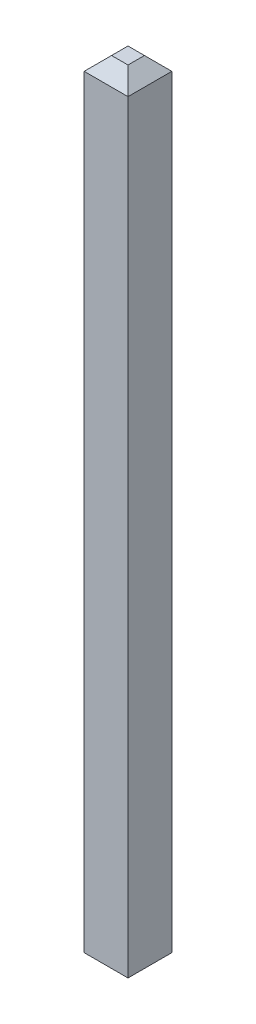
ISO-10303-21;
HEADER;
FILE_DESCRIPTION(('STEP AP214'),'2;1');
FILE_NAME('part.step','',(''),(''),'','','');
FILE_SCHEMA(('AUTOMOTIVE_DESIGN { 1 0 10303 214 1 1 1 1 }'));
ENDSEC;
DATA;
#1=APPLICATION_CONTEXT('core data for automotive mechanical design processes');
#2=APPLICATION_PROTOCOL_DEFINITION('international standard','automotive_design',2000,#1);
#3=PRODUCT_CONTEXT('',#1,'mechanical');
#4=PRODUCT('Part','Part','',(#3));
#5=PRODUCT_RELATED_PRODUCT_CATEGORY('part','',(#4));
#6=PRODUCT_DEFINITION_FORMATION('','',#4);
#7=PRODUCT_DEFINITION_CONTEXT('part definition',#1,'design');
#8=PRODUCT_DEFINITION('design','',#6,#7);
#9=PRODUCT_DEFINITION_SHAPE('','',#8);
#10=(LENGTH_UNIT() NAMED_UNIT(*) SI_UNIT(.MILLI.,.METRE.));
#11=(NAMED_UNIT(*) PLANE_ANGLE_UNIT() SI_UNIT($,.RADIAN.));
#12=(NAMED_UNIT(*) SI_UNIT($,.STERADIAN.) SOLID_ANGLE_UNIT());
#13=UNCERTAINTY_MEASURE_WITH_UNIT(LENGTH_MEASURE(1.E-05),#10,'distance_accuracy_value','');
#14=(GEOMETRIC_REPRESENTATION_CONTEXT(3) GLOBAL_UNCERTAINTY_ASSIGNED_CONTEXT((#13)) GLOBAL_UNIT_ASSIGNED_CONTEXT((#10,
#11,#12)) REPRESENTATION_CONTEXT('',''));
#15=CARTESIAN_POINT('',(0.,0.,0.));
#16=DIRECTION('',(0.,0.,1.));
#17=DIRECTION('',(1.,0.,0.));
#18=AXIS2_PLACEMENT_3D('',#15,#16,#17);
#19=CARTESIAN_POINT('',(-8.57,7.07,-0.32));
#20=DIRECTION('',(-0.707106781186548,-0.707106781186548,0.));
#21=DIRECTION('',(-0.707106781186548,0.707106781186548,0.));
#22=AXIS2_PLACEMENT_3D('',#19,#20,#21);
#23=PLANE('',#22);
#24=DIRECTION('',(0.577350269189626,-0.577350269189626,0.577350269189626));
#25=VECTOR('',#24,1.);
#26=CARTESIAN_POINT('',(-8.783333333333,7.283333333333,0.106666666667));
#27=LINE('',#26,#25);
#28=CARTESIAN_POINT('',(-8.77,7.27,0.12));
#29=VERTEX_POINT('',#28);
#30=CARTESIAN_POINT('',(-8.57,7.07,0.32));
#31=VERTEX_POINT('',#30);
#32=EDGE_CURVE('E152',#29,#31,#27,.T.);
#33=ORIENTED_EDGE('',*,*,#32,.T.);
#34=DIRECTION('',(0.,0.,1.));
#35=VECTOR('',#34,1.);
#36=CARTESIAN_POINT('',(-8.57,7.07,-0.32));
#37=LINE('',#36,#35);
#38=CARTESIAN_POINT('',(-8.57,7.07,-0.32));
#39=VERTEX_POINT('',#38);
#40=EDGE_CURVE('E171',#39,#31,#37,.T.);
#41=ORIENTED_EDGE('',*,*,#40,.F.);
#42=DIRECTION('',(0.577350269189626,-0.577350269189626,-0.577350269189626));
#43=VECTOR('',#42,1.);
#44=CARTESIAN_POINT('',(-8.57,7.07,-0.32));
#45=LINE('',#44,#43);
#46=CARTESIAN_POINT('',(-8.77,7.27,-0.12));
#47=VERTEX_POINT('',#46);
#48=EDGE_CURVE('E11',#47,#39,#45,.T.);
#49=ORIENTED_EDGE('',*,*,#48,.F.);
#50=DIRECTION('',(0.,0.,-1.));
#51=VECTOR('',#50,1.);
#52=CARTESIAN_POINT('',(-8.77,7.27,-0.32));
#53=LINE('',#52,#51);
#54=EDGE_CURVE('E173',#29,#47,#53,.T.);
#55=ORIENTED_EDGE('',*,*,#54,.F.);
#56=EDGE_LOOP('',(#33,#41,#49,#55));
#57=FACE_BOUND('',#56,.T.);
#58=ADVANCED_FACE('F16',(#57),#23,.F.);
#59=CARTESIAN_POINT('',(-8.89,7.07,-0.32));
#60=DIRECTION('',(0.,0.707106781186548,-0.707106781186548));
#61=DIRECTION('',(-1.,0.,0.));
#62=AXIS2_PLACEMENT_3D('',#59,#60,#61);
#63=PLANE('',#62);
#64=DIRECTION('',(0.577350269189626,0.577350269189626,0.577350269189626));
#65=VECTOR('',#64,1.);
#66=CARTESIAN_POINT('',(-9.076666666667,7.203333333333,-0.186666666667));
#67=LINE('',#66,#65);
#68=CARTESIAN_POINT('',(-9.21,7.07,-0.32));
#69=VERTEX_POINT('',#68);
#70=CARTESIAN_POINT('',(-9.01,7.27,-0.12));
#71=VERTEX_POINT('',#70);
#72=EDGE_CURVE('E27',#69,#71,#67,.T.);
#73=ORIENTED_EDGE('',*,*,#72,.T.);
#74=DIRECTION('',(-1.,0.,0.));
#75=VECTOR('',#74,1.);
#76=CARTESIAN_POINT('',(-9.21,7.27,-0.12));
#77=LINE('',#76,#75);
#78=EDGE_CURVE('E185',#47,#71,#77,.T.);
#79=ORIENTED_EDGE('',*,*,#78,.F.);
#80=ORIENTED_EDGE('',*,*,#48,.T.);
#81=DIRECTION('',(1.,0.,0.));
#82=VECTOR('',#81,1.);
#83=CARTESIAN_POINT('',(-8.57,7.07,-0.32));
#84=LINE('',#83,#82);
#85=EDGE_CURVE('E116',#69,#39,#84,.T.);
#86=ORIENTED_EDGE('',*,*,#85,.F.);
#87=EDGE_LOOP('',(#73,#79,#80,#86));
#88=FACE_BOUND('',#87,.T.);
#89=ADVANCED_FACE('F270',(#88),#63,.T.);
#90=CARTESIAN_POINT('',(-9.01,7.27,-0.32));
#91=DIRECTION('',(0.707106781186548,-0.707106781186548,0.));
#92=DIRECTION('',(0.,0.,-1.));
#93=AXIS2_PLACEMENT_3D('',#90,#91,#92);
#94=PLANE('',#93);
#95=DIRECTION('',(-0.577350269189626,-0.577350269189626,0.577350269189626));
#96=VECTOR('',#95,1.);
#97=CARTESIAN_POINT('',(-9.076666666667,7.203333333333,0.186666666667));
#98=LINE('',#97,#96);
#99=CARTESIAN_POINT('',(-9.01,7.27,0.12));
#100=VERTEX_POINT('',#99);
#101=CARTESIAN_POINT('',(-9.21,7.07,0.32));
#102=VERTEX_POINT('',#101);
#103=EDGE_CURVE('E41',#100,#102,#98,.T.);
#104=ORIENTED_EDGE('',*,*,#103,.F.);
#105=DIRECTION('',(0.,0.,1.));
#106=VECTOR('',#105,1.);
#107=CARTESIAN_POINT('',(-9.01,7.27,-0.32));
#108=LINE('',#107,#106);
#109=EDGE_CURVE('E189',#71,#100,#108,.T.);
#110=ORIENTED_EDGE('',*,*,#109,.F.);
#111=ORIENTED_EDGE('',*,*,#72,.F.);
#112=DIRECTION('',(0.,0.,-1.));
#113=VECTOR('',#112,1.);
#114=CARTESIAN_POINT('',(-9.21,7.07,-0.32));
#115=LINE('',#114,#113);
#116=EDGE_CURVE('E144',#102,#69,#115,.T.);
#117=ORIENTED_EDGE('',*,*,#116,.F.);
#118=EDGE_LOOP('',(#104,#110,#111,#117));
#119=FACE_BOUND('',#118,.T.);
#120=ADVANCED_FACE('F18',(#119),#94,.F.);
#121=CARTESIAN_POINT('',(-9.21,7.27,0.12));
#122=DIRECTION('',(0.,-0.707106781186548,-0.707106781186548));
#123=DIRECTION('',(0.,-0.707106781186548,0.707106781186548));
#124=AXIS2_PLACEMENT_3D('',#121,#122,#123);
#125=PLANE('',#124);
#126=ORIENTED_EDGE('',*,*,#32,.F.);
#127=DIRECTION('',(1.,0.,0.));
#128=VECTOR('',#127,1.);
#129=CARTESIAN_POINT('',(-9.21,7.27,0.12));
#130=LINE('',#129,#128);
#131=EDGE_CURVE('E141',#100,#29,#130,.T.);
#132=ORIENTED_EDGE('',*,*,#131,.F.);
#133=ORIENTED_EDGE('',*,*,#103,.T.);
#134=DIRECTION('',(-1.,0.,0.));
#135=VECTOR('',#134,1.);
#136=CARTESIAN_POINT('',(-8.89,7.07,0.32));
#137=LINE('',#136,#135);
#138=EDGE_CURVE('E174',#31,#102,#137,.T.);
#139=ORIENTED_EDGE('',*,*,#138,.F.);
#140=EDGE_LOOP('',(#126,#132,#133,#139));
#141=FACE_BOUND('',#140,.T.);
#142=ADVANCED_FACE('F261',(#141),#125,.F.);
#143=CARTESIAN_POINT('',(-9.21,7.27,-0.32));
#144=DIRECTION('',(0.,-1.,0.));
#145=DIRECTION('',(0.,0.,-1.));
#146=AXIS2_PLACEMENT_3D('',#143,#144,#145);
#147=PLANE('',#146);
#148=ORIENTED_EDGE('',*,*,#54,.T.);
#149=ORIENTED_EDGE('',*,*,#78,.T.);
#150=ORIENTED_EDGE('',*,*,#109,.T.);
#151=ORIENTED_EDGE('',*,*,#131,.T.);
#152=EDGE_LOOP('',(#148,#149,#150,#151));
#153=FACE_BOUND('',#152,.T.);
#154=ADVANCED_FACE('F265',(#153),#147,.F.);
#155=CARTESIAN_POINT('',(-8.57,7.27,-0.32));
#156=DIRECTION('',(-1.,0.,0.));
#157=DIRECTION('',(0.,1.,0.));
#158=AXIS2_PLACEMENT_3D('',#155,#156,#157);
#159=PLANE('',#158);
#160=DIRECTION('',(0.,-1.,0.));
#161=VECTOR('',#160,1.);
#162=CARTESIAN_POINT('',(-8.57,7.27,-0.32));
#163=LINE('',#162,#161);
#164=CARTESIAN_POINT('',(-8.57,-4.07,-0.32));
#165=VERTEX_POINT('',#164);
#166=EDGE_CURVE('E98',#39,#165,#163,.T.);
#167=ORIENTED_EDGE('',*,*,#166,.F.);
#168=ORIENTED_EDGE('',*,*,#40,.T.);
#169=DIRECTION('',(0.,-1.,0.));
#170=VECTOR('',#169,1.);
#171=CARTESIAN_POINT('',(-8.57,7.27,0.32));
#172=LINE('',#171,#170);
#173=CARTESIAN_POINT('',(-8.57,-4.07,0.32));
#174=VERTEX_POINT('',#173);
#175=EDGE_CURVE('E101',#31,#174,#172,.T.);
#176=ORIENTED_EDGE('',*,*,#175,.T.);
#177=DIRECTION('',(0.,0.,-1.));
#178=VECTOR('',#177,1.);
#179=CARTESIAN_POINT('',(-8.57,-4.07,-0.32));
#180=LINE('',#179,#178);
#181=EDGE_CURVE('E94',#174,#165,#180,.T.);
#182=ORIENTED_EDGE('',*,*,#181,.T.);
#183=EDGE_LOOP('',(#167,#168,#176,#182));
#184=FACE_BOUND('',#183,.T.);
#185=ADVANCED_FACE('F96',(#184),#159,.F.);
#186=CARTESIAN_POINT('',(-8.89,1.5,0.32));
#187=DIRECTION('',(0.,0.,-1.));
#188=DIRECTION('',(0.,-1.,0.));
#189=AXIS2_PLACEMENT_3D('',#186,#187,#188);
#190=PLANE('',#189);
#191=ORIENTED_EDGE('',*,*,#175,.F.);
#192=ORIENTED_EDGE('',*,*,#138,.T.);
#193=DIRECTION('',(0.,1.,0.));
#194=VECTOR('',#193,1.);
#195=CARTESIAN_POINT('',(-9.21,-4.27,0.32));
#196=LINE('',#195,#194);
#197=CARTESIAN_POINT('',(-9.21,-4.07,0.32));
#198=VERTEX_POINT('',#197);
#199=EDGE_CURVE('E20',#198,#102,#196,.T.);
#200=ORIENTED_EDGE('',*,*,#199,.F.);
#201=DIRECTION('',(1.,0.,0.));
#202=VECTOR('',#201,1.);
#203=CARTESIAN_POINT('',(-8.89,-4.07,0.32));
#204=LINE('',#203,#202);
#205=EDGE_CURVE('E106',#198,#174,#204,.T.);
#206=ORIENTED_EDGE('',*,*,#205,.T.);
#207=EDGE_LOOP('',(#191,#192,#200,#206));
#208=FACE_BOUND('',#207,.T.);
#209=ADVANCED_FACE('F207',(#208),#190,.F.);
#210=CARTESIAN_POINT('',(-8.77,-4.27,-0.32));
#211=DIRECTION('',(-0.707106781186548,0.707106781186548,0.));
#212=DIRECTION('',(0.,0.,1.));
#213=AXIS2_PLACEMENT_3D('',#210,#211,#212);
#214=PLANE('',#213);
#215=DIRECTION('',(-0.577350269189626,-0.577350269189626,0.577350269189626));
#216=VECTOR('',#215,1.);
#217=CARTESIAN_POINT('',(-8.703333333333,-4.203333333333,-0.186666666667));
#218=LINE('',#217,#216);
#219=CARTESIAN_POINT('',(-8.77,-4.27,-0.12));
#220=VERTEX_POINT('',#219);
#221=EDGE_CURVE('E120',#165,#220,#218,.T.);
#222=ORIENTED_EDGE('',*,*,#221,.F.);
#223=ORIENTED_EDGE('',*,*,#181,.F.);
#224=DIRECTION('',(-0.577350269189626,-0.577350269189626,-0.577350269189626));
#225=VECTOR('',#224,1.);
#226=CARTESIAN_POINT('',(-8.916666666667,-4.416666666667,-0.02666666666667));
#227=LINE('',#226,#225);
#228=CARTESIAN_POINT('',(-8.77,-4.27,0.12));
#229=VERTEX_POINT('',#228);
#230=EDGE_CURVE('E155',#174,#229,#227,.T.);
#231=ORIENTED_EDGE('',*,*,#230,.T.);
#232=DIRECTION('',(0.,0.,1.));
#233=VECTOR('',#232,1.);
#234=CARTESIAN_POINT('',(-8.77,-4.27,-0.32));
#235=LINE('',#234,#233);
#236=EDGE_CURVE('E123',#220,#229,#235,.T.);
#237=ORIENTED_EDGE('',*,*,#236,.F.);
#238=EDGE_LOOP('',(#222,#223,#231,#237));
#239=FACE_BOUND('',#238,.T.);
#240=ADVANCED_FACE('F121',(#239),#214,.F.);
#241=CARTESIAN_POINT('',(-8.57,-4.27,0.12));
#242=DIRECTION('',(0.,0.707106781186548,-0.707106781186548));
#243=DIRECTION('',(-1.,0.,0.));
#244=AXIS2_PLACEMENT_3D('',#241,#242,#243);
#245=PLANE('',#244);
#246=ORIENTED_EDGE('',*,*,#230,.F.);
#247=ORIENTED_EDGE('',*,*,#205,.F.);
#248=DIRECTION('',(-0.577350269189626,0.577350269189626,0.577350269189626));
#249=VECTOR('',#248,1.);
#250=CARTESIAN_POINT('',(-8.996666666667,-4.283333333333,0.106666666667));
#251=LINE('',#250,#249);
#252=CARTESIAN_POINT('',(-9.01,-4.27,0.12));
#253=VERTEX_POINT('',#252);
#254=EDGE_CURVE('E143',#253,#198,#251,.T.);
#255=ORIENTED_EDGE('',*,*,#254,.F.);
#256=DIRECTION('',(-1.,0.,0.));
#257=VECTOR('',#256,1.);
#258=CARTESIAN_POINT('',(-8.57,-4.27,0.12));
#259=LINE('',#258,#257);
#260=EDGE_CURVE('E148',#229,#253,#259,.T.);
#261=ORIENTED_EDGE('',*,*,#260,.F.);
#262=EDGE_LOOP('',(#246,#247,#255,#261));
#263=FACE_BOUND('',#262,.T.);
#264=ADVANCED_FACE('F252',(#263),#245,.F.);
#265=CARTESIAN_POINT('',(-9.21,-4.07,-0.32));
#266=DIRECTION('',(0.707106781186548,0.707106781186548,0.));
#267=DIRECTION('',(0.,0.,-1.));
#268=AXIS2_PLACEMENT_3D('',#265,#266,#267);
#269=PLANE('',#268);
#270=DIRECTION('',(0.577350269189626,-0.577350269189626,0.577350269189626));
#271=VECTOR('',#270,1.);
#272=CARTESIAN_POINT('',(-9.103333333333,-4.176666666667,-0.213333333333));
#273=LINE('',#272,#271);
#274=CARTESIAN_POINT('',(-9.21,-4.07,-0.32));
#275=VERTEX_POINT('',#274);
#276=CARTESIAN_POINT('',(-9.01,-4.27,-0.12));
#277=VERTEX_POINT('',#276);
#278=EDGE_CURVE('E131',#275,#277,#273,.T.);
#279=ORIENTED_EDGE('',*,*,#278,.T.);
#280=DIRECTION('',(0.,0.,-1.));
#281=VECTOR('',#280,1.);
#282=CARTESIAN_POINT('',(-9.01,-4.27,-0.32));
#283=LINE('',#282,#281);
#284=EDGE_CURVE('E177',#253,#277,#283,.T.);
#285=ORIENTED_EDGE('',*,*,#284,.F.);
#286=ORIENTED_EDGE('',*,*,#254,.T.);
#287=DIRECTION('',(0.,0.,1.));
#288=VECTOR('',#287,1.);
#289=CARTESIAN_POINT('',(-9.21,-4.07,-0.32));
#290=LINE('',#289,#288);
#291=EDGE_CURVE('E85',#275,#198,#290,.T.);
#292=ORIENTED_EDGE('',*,*,#291,.F.);
#293=EDGE_LOOP('',(#279,#285,#286,#292));
#294=FACE_BOUND('',#293,.T.);
#295=ADVANCED_FACE('F223',(#294),#269,.F.);
#296=CARTESIAN_POINT('',(-9.21,-4.27,-0.32));
#297=DIRECTION('',(1.,0.,0.));
#298=DIRECTION('',(0.,0.,1.));
#299=AXIS2_PLACEMENT_3D('',#296,#297,#298);
#300=PLANE('',#299);
#301=ORIENTED_EDGE('',*,*,#199,.T.);
#302=ORIENTED_EDGE('',*,*,#116,.T.);
#303=DIRECTION('',(0.,1.,0.));
#304=VECTOR('',#303,1.);
#305=CARTESIAN_POINT('',(-9.21,-4.27,-0.32));
#306=LINE('',#305,#304);
#307=EDGE_CURVE('E128',#275,#69,#306,.T.);
#308=ORIENTED_EDGE('',*,*,#307,.F.);
#309=ORIENTED_EDGE('',*,*,#291,.T.);
#310=EDGE_LOOP('',(#301,#302,#308,#309));
#311=FACE_BOUND('',#310,.T.);
#312=ADVANCED_FACE('F212',(#311),#300,.F.);
#313=CARTESIAN_POINT('',(-8.89,1.5,-0.32));
#314=DIRECTION('',(0.,0.,-1.));
#315=DIRECTION('',(0.,-1.,0.));
#316=AXIS2_PLACEMENT_3D('',#313,#314,#315);
#317=PLANE('',#316);
#318=ORIENTED_EDGE('',*,*,#307,.T.);
#319=ORIENTED_EDGE('',*,*,#85,.T.);
#320=ORIENTED_EDGE('',*,*,#166,.T.);
#321=DIRECTION('',(-1.,0.,0.));
#322=VECTOR('',#321,1.);
#323=CARTESIAN_POINT('',(-9.21,-4.07,-0.32));
#324=LINE('',#323,#322);
#325=EDGE_CURVE('E113',#165,#275,#324,.T.);
#326=ORIENTED_EDGE('',*,*,#325,.T.);
#327=EDGE_LOOP('',(#318,#319,#320,#326));
#328=FACE_BOUND('',#327,.T.);
#329=ADVANCED_FACE('F111',(#328),#317,.T.);
#330=CARTESIAN_POINT('',(-8.89,-4.07,-0.32));
#331=DIRECTION('',(0.,-0.707106781186548,-0.707106781186548));
#332=DIRECTION('',(0.,-0.707106781186548,0.707106781186548));
#333=AXIS2_PLACEMENT_3D('',#330,#331,#332);
#334=PLANE('',#333);
#335=ORIENTED_EDGE('',*,*,#278,.F.);
#336=ORIENTED_EDGE('',*,*,#325,.F.);
#337=ORIENTED_EDGE('',*,*,#221,.T.);
#338=DIRECTION('',(1.,0.,0.));
#339=VECTOR('',#338,1.);
#340=CARTESIAN_POINT('',(-8.57,-4.27,-0.12));
#341=LINE('',#340,#339);
#342=EDGE_CURVE('E138',#277,#220,#341,.T.);
#343=ORIENTED_EDGE('',*,*,#342,.F.);
#344=EDGE_LOOP('',(#335,#336,#337,#343));
#345=FACE_BOUND('',#344,.T.);
#346=ADVANCED_FACE('F130',(#345),#334,.T.);
#347=CARTESIAN_POINT('',(-8.57,-4.27,-0.32));
#348=DIRECTION('',(0.,1.,0.));
#349=DIRECTION('',(0.,0.,-1.));
#350=AXIS2_PLACEMENT_3D('',#347,#348,#349);
#351=PLANE('',#350);
#352=ORIENTED_EDGE('',*,*,#236,.T.);
#353=ORIENTED_EDGE('',*,*,#260,.T.);
#354=ORIENTED_EDGE('',*,*,#284,.T.);
#355=ORIENTED_EDGE('',*,*,#342,.T.);
#356=EDGE_LOOP('',(#352,#353,#354,#355));
#357=FACE_BOUND('',#356,.T.);
#358=ADVANCED_FACE('F232',(#357),#351,.F.);
#359=CLOSED_SHELL('',(#58,#89,#120,#142,#154,#185,#209,#240,#264,#295,#312,#329,#346,#358));
#360=MANIFOLD_SOLID_BREP('B1',#359);
#361=ADVANCED_BREP_SHAPE_REPRESENTATION('',(#18,#360),#14);
#362=SHAPE_DEFINITION_REPRESENTATION(#9,#361);
ENDSEC;
END-ISO-10303-21;
